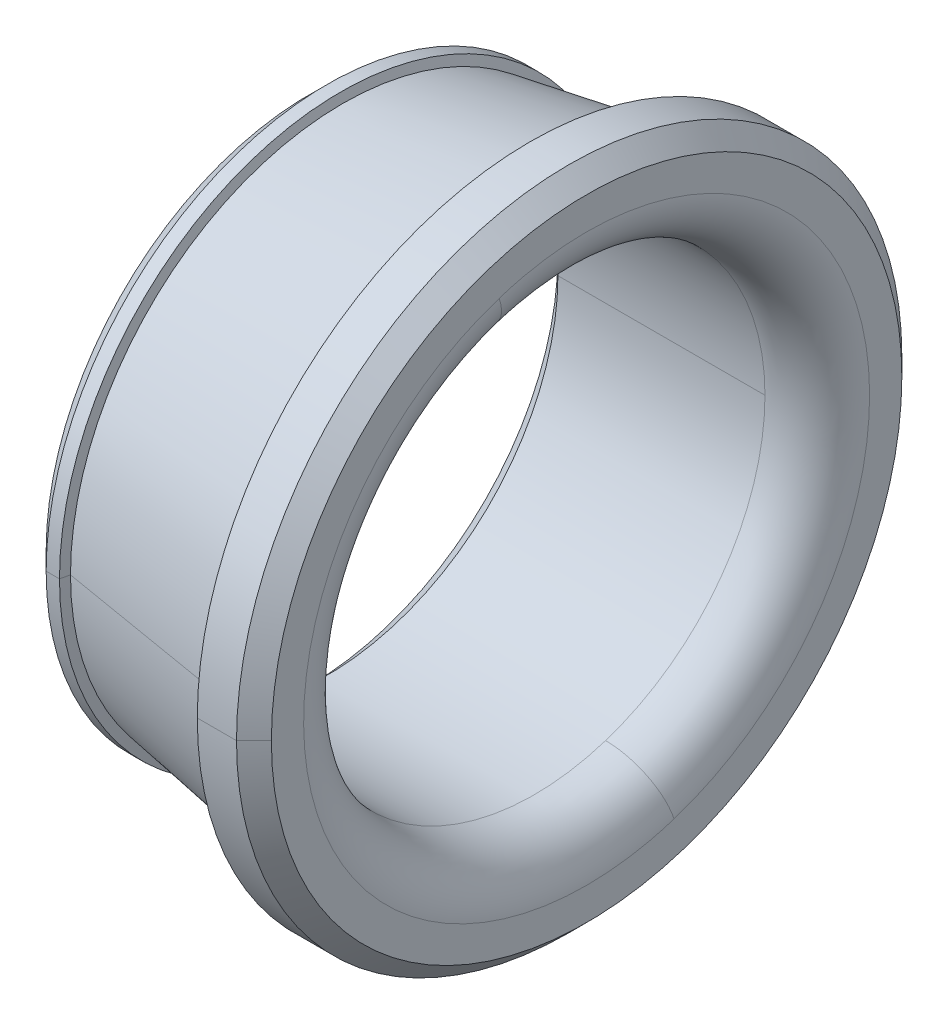
ISO-10303-21;
HEADER;
FILE_DESCRIPTION(('STEP AP214'),'2;1');
FILE_NAME('part.step','',(''),(''),'','','');
FILE_SCHEMA(('AUTOMOTIVE_DESIGN { 1 0 10303 214 1 1 1 1 }'));
ENDSEC;
DATA;
#1=APPLICATION_CONTEXT('core data for automotive mechanical design processes');
#2=APPLICATION_PROTOCOL_DEFINITION('international standard','automotive_design',2000,#1);
#3=PRODUCT_CONTEXT('',#1,'mechanical');
#4=PRODUCT('Part','Part','',(#3));
#5=PRODUCT_RELATED_PRODUCT_CATEGORY('part','',(#4));
#6=PRODUCT_DEFINITION_FORMATION('','',#4);
#7=PRODUCT_DEFINITION_CONTEXT('part definition',#1,'design');
#8=PRODUCT_DEFINITION('design','',#6,#7);
#9=PRODUCT_DEFINITION_SHAPE('','',#8);
#10=(LENGTH_UNIT() NAMED_UNIT(*) SI_UNIT(.MILLI.,.METRE.));
#11=(NAMED_UNIT(*) PLANE_ANGLE_UNIT() SI_UNIT($,.RADIAN.));
#12=(NAMED_UNIT(*) SI_UNIT($,.STERADIAN.) SOLID_ANGLE_UNIT());
#13=UNCERTAINTY_MEASURE_WITH_UNIT(LENGTH_MEASURE(1.E-05),#10,'distance_accuracy_value','');
#14=(GEOMETRIC_REPRESENTATION_CONTEXT(3) GLOBAL_UNCERTAINTY_ASSIGNED_CONTEXT((#13)) GLOBAL_UNIT_ASSIGNED_CONTEXT((#10,
#11,#12)) REPRESENTATION_CONTEXT('',''));
#15=CARTESIAN_POINT('',(0.,0.,0.));
#16=DIRECTION('',(0.,0.,1.));
#17=DIRECTION('',(1.,0.,0.));
#18=AXIS2_PLACEMENT_3D('',#15,#16,#17);
#19=CARTESIAN_POINT('',(-0.889,18.145,0.));
#20=DIRECTION('',(-1.,0.,0.));
#21=DIRECTION('',(0.,0.,1.));
#22=AXIS2_PLACEMENT_3D('',#19,#20,#21);
#23=PLANE('',#22);
#24=CARTESIAN_POINT('',(-0.889,0.,0.));
#25=DIRECTION('',(1.,0.,0.));
#26=DIRECTION('',(0.,0.,-1.));
#27=AXIS2_PLACEMENT_3D('',#24,#25,#26);
#28=CIRCLE('',#27,17.075);
#29=CARTESIAN_POINT('',(-0.889,0.,-17.075));
#30=VERTEX_POINT('',#29);
#31=CARTESIAN_POINT('',(-0.888999999999996,0.,17.075));
#32=VERTEX_POINT('',#31);
#33=EDGE_CURVE('E11',#30,#32,#28,.T.);
#34=ORIENTED_EDGE('',*,*,#33,.T.);
#35=CARTESIAN_POINT('',(-0.889,0.,0.));
#36=DIRECTION('',(1.,0.,0.));
#37=DIRECTION('',(0.,0.,-1.));
#38=AXIS2_PLACEMENT_3D('',#35,#36,#37);
#39=CIRCLE('',#38,17.075);
#40=EDGE_CURVE('E25',#32,#30,#39,.T.);
#41=ORIENTED_EDGE('',*,*,#40,.T.);
#42=EDGE_LOOP('',(#34,#41));
#43=FACE_BOUND('',#42,.T.);
#44=CARTESIAN_POINT('',(-0.889,0.,0.));
#45=DIRECTION('',(1.,0.,0.));
#46=DIRECTION('',(0.,0.,-1.));
#47=AXIS2_PLACEMENT_3D('',#44,#45,#46);
#48=CIRCLE('',#47,18.145);
#49=CARTESIAN_POINT('',(-0.889000000000003,0.,18.145));
#50=VERTEX_POINT('',#49);
#51=CARTESIAN_POINT('',(-0.889,0.,-18.145));
#52=VERTEX_POINT('',#51);
#53=EDGE_CURVE('E371',#50,#52,#48,.T.);
#54=ORIENTED_EDGE('',*,*,#53,.F.);
#55=CARTESIAN_POINT('',(-0.889,0.,0.));
#56=DIRECTION('',(1.,0.,0.));
#57=DIRECTION('',(0.,0.,-1.));
#58=AXIS2_PLACEMENT_3D('',#55,#56,#57);
#59=CIRCLE('',#58,18.145);
#60=EDGE_CURVE('E366',#52,#50,#59,.T.);
#61=ORIENTED_EDGE('',*,*,#60,.F.);
#62=EDGE_LOOP('',(#54,#61));
#63=FACE_BOUND('',#62,.T.);
#64=ADVANCED_FACE('F17',(#43,#63),#23,.T.);
#65=CARTESIAN_POINT('',(0.311,0.,0.));
#66=DIRECTION('',(1.,0.,0.));
#67=DIRECTION('',(0.,-1.,0.));
#68=AXIS2_PLACEMENT_3D('',#65,#66,#67);
#69=CONICAL_SURFACE('',#68,19.345,0.785398163397447);
#70=DIRECTION('',(0.707106781186549,0.,0.707106781186546));
#71=VECTOR('',#70,1.);
#72=CARTESIAN_POINT('',(-0.889000000000003,0.,18.145));
#73=LINE('',#72,#71);
#74=CARTESIAN_POINT('',(0.311,0.,19.345));
#75=VERTEX_POINT('',#74);
#76=EDGE_CURVE('E362',#50,#75,#73,.T.);
#77=ORIENTED_EDGE('',*,*,#76,.T.);
#78=CARTESIAN_POINT('',(0.311,0.,0.));
#79=DIRECTION('',(1.,0.,0.));
#80=DIRECTION('',(0.,0.,-1.));
#81=AXIS2_PLACEMENT_3D('',#78,#79,#80);
#82=CIRCLE('',#81,19.345);
#83=CARTESIAN_POINT('',(0.311,0.,-19.345));
#84=VERTEX_POINT('',#83);
#85=EDGE_CURVE('E357',#84,#75,#82,.T.);
#86=ORIENTED_EDGE('',*,*,#85,.F.);
#87=DIRECTION('',(0.707106781186549,0.,-0.707106781186546));
#88=VECTOR('',#87,1.);
#89=CARTESIAN_POINT('',(-0.889000000000003,0.,-18.145));
#90=LINE('',#89,#88);
#91=EDGE_CURVE('E352',#52,#84,#90,.T.);
#92=ORIENTED_EDGE('',*,*,#91,.F.);
#93=ORIENTED_EDGE('',*,*,#60,.T.);
#94=EDGE_LOOP('',(#77,#86,#92,#93));
#95=FACE_BOUND('',#94,.T.);
#96=ADVANCED_FACE('F387',(#95),#69,.T.);
#97=CARTESIAN_POINT('',(0.311,0.,0.));
#98=DIRECTION('',(1.,0.,0.));
#99=DIRECTION('',(0.,1.,0.));
#100=AXIS2_PLACEMENT_3D('',#97,#98,#99);
#101=CONICAL_SURFACE('',#100,19.345,0.785398163397447);
#102=ORIENTED_EDGE('',*,*,#76,.F.);
#103=ORIENTED_EDGE('',*,*,#53,.T.);
#104=ORIENTED_EDGE('',*,*,#91,.T.);
#105=CARTESIAN_POINT('',(0.311,0.,0.));
#106=DIRECTION('',(1.,0.,0.));
#107=DIRECTION('',(0.,0.,-1.));
#108=AXIS2_PLACEMENT_3D('',#105,#106,#107);
#109=CIRCLE('',#108,19.345);
#110=EDGE_CURVE('E347',#75,#84,#109,.T.);
#111=ORIENTED_EDGE('',*,*,#110,.F.);
#112=EDGE_LOOP('',(#102,#103,#104,#111));
#113=FACE_BOUND('',#112,.T.);
#114=ADVANCED_FACE('F382',(#113),#101,.T.);
#115=CARTESIAN_POINT('',(18.161,0.,0.));
#116=DIRECTION('',(1.,0.,0.));
#117=DIRECTION('',(0.,1.,-3.68433231910584E-13));
#118=AXIS2_PLACEMENT_3D('',#115,#116,#117);
#119=CYLINDRICAL_SURFACE('',#118,19.345);
#120=DIRECTION('',(1.,0.,0.));
#121=VECTOR('',#120,1.);
#122=CARTESIAN_POINT('',(0.311,0.,19.345));
#123=LINE('',#122,#121);
#124=CARTESIAN_POINT('',(1.2282218611991,0.,19.345));
#125=VERTEX_POINT('',#124);
#126=EDGE_CURVE('E342',#75,#125,#123,.T.);
#127=ORIENTED_EDGE('',*,*,#126,.F.);
#128=ORIENTED_EDGE('',*,*,#110,.T.);
#129=DIRECTION('',(1.,0.,0.));
#130=VECTOR('',#129,1.);
#131=CARTESIAN_POINT('',(0.311,0.,-19.345));
#132=LINE('',#131,#130);
#133=CARTESIAN_POINT('',(1.2282218611991,0.,-19.345));
#134=VERTEX_POINT('',#133);
#135=EDGE_CURVE('E338',#84,#134,#132,.T.);
#136=ORIENTED_EDGE('',*,*,#135,.T.);
#137=CARTESIAN_POINT('',(1.2282218611991,0.,0.));
#138=DIRECTION('',(1.,0.,0.));
#139=DIRECTION('',(0.,0.,-1.));
#140=AXIS2_PLACEMENT_3D('',#137,#138,#139);
#141=CIRCLE('',#140,19.345);
#142=EDGE_CURVE('E333',#125,#134,#141,.T.);
#143=ORIENTED_EDGE('',*,*,#142,.F.);
#144=EDGE_LOOP('',(#127,#128,#136,#143));
#145=FACE_BOUND('',#144,.T.);
#146=ADVANCED_FACE('F394',(#145),#119,.T.);
#147=CARTESIAN_POINT('',(1.3717754222754,0.,0.));
#148=DIRECTION('',(-1.,0.,0.));
#149=DIRECTION('',(0.,1.,0.));
#150=AXIS2_PLACEMENT_3D('',#147,#148,#149);
#151=CONICAL_SURFACE('',#150,18.73054483737,1.34128553015773);
#152=DIRECTION('',(-0.227501175399693,0.,-0.973777805863205));
#153=VECTOR('',#152,1.);
#154=CARTESIAN_POINT('',(1.37177542227541,0.,-18.73054483737));
#155=LINE('',#154,#153);
#156=CARTESIAN_POINT('',(1.3717754222754,0.,-18.73054483737));
#157=VERTEX_POINT('',#156);
#158=EDGE_CURVE('E328',#157,#134,#155,.T.);
#159=ORIENTED_EDGE('',*,*,#158,.F.);
#160=CARTESIAN_POINT('',(1.3717754222754,0.,0.));
#161=DIRECTION('',(1.,0.,0.));
#162=DIRECTION('',(0.,0.,-1.));
#163=AXIS2_PLACEMENT_3D('',#160,#161,#162);
#164=CIRCLE('',#163,18.73054483737);
#165=CARTESIAN_POINT('',(1.37177542227541,0.,18.73054483737));
#166=VERTEX_POINT('',#165);
#167=EDGE_CURVE('E323',#166,#157,#164,.T.);
#168=ORIENTED_EDGE('',*,*,#167,.F.);
#169=DIRECTION('',(-0.227501175399693,0.,0.973777805863205));
#170=VECTOR('',#169,1.);
#171=CARTESIAN_POINT('',(1.37177542227541,0.,18.73054483737));
#172=LINE('',#171,#170);
#173=EDGE_CURVE('E318',#166,#125,#172,.T.);
#174=ORIENTED_EDGE('',*,*,#173,.T.);
#175=ORIENTED_EDGE('',*,*,#142,.T.);
#176=EDGE_LOOP('',(#159,#168,#174,#175));
#177=FACE_BOUND('',#176,.T.);
#178=ADVANCED_FACE('F396',(#177),#151,.T.);
#179=CARTESIAN_POINT('',(1.3717754222754,0.,0.));
#180=DIRECTION('',(-1.,0.,0.));
#181=DIRECTION('',(0.,-1.,0.));
#182=AXIS2_PLACEMENT_3D('',#179,#180,#181);
#183=CONICAL_SURFACE('',#182,18.73054483737,1.34128553015773);
#184=ORIENTED_EDGE('',*,*,#158,.T.);
#185=CARTESIAN_POINT('',(1.2282218611991,0.,0.));
#186=DIRECTION('',(1.,0.,0.));
#187=DIRECTION('',(0.,0.,-1.));
#188=AXIS2_PLACEMENT_3D('',#185,#186,#187);
#189=CIRCLE('',#188,19.345);
#190=EDGE_CURVE('E313',#134,#125,#189,.T.);
#191=ORIENTED_EDGE('',*,*,#190,.T.);
#192=ORIENTED_EDGE('',*,*,#173,.F.);
#193=CARTESIAN_POINT('',(1.3717754222754,0.,0.));
#194=DIRECTION('',(1.,0.,0.));
#195=DIRECTION('',(0.,0.,-1.));
#196=AXIS2_PLACEMENT_3D('',#193,#194,#195);
#197=CIRCLE('',#196,18.73054483737);
#198=EDGE_CURVE('E308',#157,#166,#197,.T.);
#199=ORIENTED_EDGE('',*,*,#198,.F.);
#200=EDGE_LOOP('',(#184,#191,#192,#199));
#201=FACE_BOUND('',#200,.T.);
#202=ADVANCED_FACE('F401',(#201),#183,.T.);
#203=CARTESIAN_POINT('',(14.70922761171,0.,0.));
#204=DIRECTION('',(1.,0.,0.));
#205=DIRECTION('',(0.,-1.,0.));
#206=AXIS2_PLACEMENT_3D('',#203,#204,#205);
#207=CONICAL_SURFACE('',#206,20.982335713908,0.167254902218641);
#208=DIRECTION('',(0.986045474952207,0.,0.166476188466329));
#209=VECTOR('',#208,1.);
#210=CARTESIAN_POINT('',(1.3717754222754,0.,18.73054483737));
#211=LINE('',#210,#209);
#212=CARTESIAN_POINT('',(14.70922761171,0.,20.982335713908));
#213=VERTEX_POINT('',#212);
#214=EDGE_CURVE('E304',#166,#213,#211,.T.);
#215=ORIENTED_EDGE('',*,*,#214,.T.);
#216=CARTESIAN_POINT('',(14.70922761171,0.,0.));
#217=DIRECTION('',(1.,0.,0.));
#218=DIRECTION('',(0.,0.,-1.));
#219=AXIS2_PLACEMENT_3D('',#216,#217,#218);
#220=CIRCLE('',#219,20.982335713908);
#221=CARTESIAN_POINT('',(14.70922761171,0.,-20.982335713908));
#222=VERTEX_POINT('',#221);
#223=EDGE_CURVE('E299',#222,#213,#220,.T.);
#224=ORIENTED_EDGE('',*,*,#223,.F.);
#225=DIRECTION('',(0.986045474952207,0.,-0.166476188466329));
#226=VECTOR('',#225,1.);
#227=CARTESIAN_POINT('',(1.3717754222754,0.,-18.73054483737));
#228=LINE('',#227,#226);
#229=EDGE_CURVE('E294',#157,#222,#228,.T.);
#230=ORIENTED_EDGE('',*,*,#229,.F.);
#231=ORIENTED_EDGE('',*,*,#198,.T.);
#232=EDGE_LOOP('',(#215,#224,#230,#231));
#233=FACE_BOUND('',#232,.T.);
#234=ADVANCED_FACE('F408',(#233),#207,.T.);
#235=CARTESIAN_POINT('',(14.70922761171,0.,0.));
#236=DIRECTION('',(1.,0.,0.));
#237=DIRECTION('',(0.,1.,0.));
#238=AXIS2_PLACEMENT_3D('',#235,#236,#237);
#239=CONICAL_SURFACE('',#238,20.982335713908,0.167254902218641);
#240=ORIENTED_EDGE('',*,*,#214,.F.);
#241=ORIENTED_EDGE('',*,*,#167,.T.);
#242=ORIENTED_EDGE('',*,*,#229,.T.);
#243=CARTESIAN_POINT('',(14.70922761171,0.,0.));
#244=DIRECTION('',(1.,0.,0.));
#245=DIRECTION('',(0.,0.,-1.));
#246=AXIS2_PLACEMENT_3D('',#243,#244,#245);
#247=CIRCLE('',#246,20.982335713908);
#248=EDGE_CURVE('E289',#213,#222,#247,.T.);
#249=ORIENTED_EDGE('',*,*,#248,.F.);
#250=EDGE_LOOP('',(#240,#241,#242,#249));
#251=FACE_BOUND('',#250,.T.);
#252=ADVANCED_FACE('F405',(#251),#239,.T.);
#253=CARTESIAN_POINT('',(14.262376830545,0.,0.));
#254=DIRECTION('',(-1.,0.,0.));
#255=DIRECTION('',(0.,1.,0.));
#256=AXIS2_PLACEMENT_3D('',#253,#254,#255);
#257=CONICAL_SURFACE('',#256,22.895,1.34128553015764);
#258=DIRECTION('',(-0.227501175399776,0.,-0.973777805863186));
#259=VECTOR('',#258,1.);
#260=CARTESIAN_POINT('',(14.70922761171,0.,-20.982335713908));
#261=LINE('',#260,#259);
#262=CARTESIAN_POINT('',(14.262376830545,0.,-22.895));
#263=VERTEX_POINT('',#262);
#264=EDGE_CURVE('E285',#222,#263,#261,.T.);
#265=ORIENTED_EDGE('',*,*,#264,.T.);
#266=CARTESIAN_POINT('',(14.262376830545,0.,0.));
#267=DIRECTION('',(1.,0.,0.));
#268=DIRECTION('',(0.,0.,-1.));
#269=AXIS2_PLACEMENT_3D('',#266,#267,#268);
#270=CIRCLE('',#269,22.895);
#271=CARTESIAN_POINT('',(14.262376830545,0.,22.895));
#272=VERTEX_POINT('',#271);
#273=EDGE_CURVE('E280',#272,#263,#270,.T.);
#274=ORIENTED_EDGE('',*,*,#273,.F.);
#275=DIRECTION('',(-0.227501175399777,0.,0.973777805863186));
#276=VECTOR('',#275,1.);
#277=CARTESIAN_POINT('',(14.70922761171,0.,20.982335713908));
#278=LINE('',#277,#276);
#279=EDGE_CURVE('E275',#213,#272,#278,.T.);
#280=ORIENTED_EDGE('',*,*,#279,.F.);
#281=ORIENTED_EDGE('',*,*,#248,.T.);
#282=EDGE_LOOP('',(#265,#274,#280,#281));
#283=FACE_BOUND('',#282,.T.);
#284=ADVANCED_FACE('F410',(#283),#257,.F.);
#285=CARTESIAN_POINT('',(14.262376830545,0.,0.));
#286=DIRECTION('',(-1.,0.,0.));
#287=DIRECTION('',(0.,-1.,0.));
#288=AXIS2_PLACEMENT_3D('',#285,#286,#287);
#289=CONICAL_SURFACE('',#288,22.895,1.34128553015764);
#290=ORIENTED_EDGE('',*,*,#264,.F.);
#291=ORIENTED_EDGE('',*,*,#223,.T.);
#292=ORIENTED_EDGE('',*,*,#279,.T.);
#293=CARTESIAN_POINT('',(14.262376830545,0.,0.));
#294=DIRECTION('',(1.,0.,0.));
#295=DIRECTION('',(0.,0.,-1.));
#296=AXIS2_PLACEMENT_3D('',#293,#294,#295);
#297=CIRCLE('',#296,22.895);
#298=EDGE_CURVE('E270',#263,#272,#297,.T.);
#299=ORIENTED_EDGE('',*,*,#298,.F.);
#300=EDGE_LOOP('',(#290,#291,#292,#299));
#301=FACE_BOUND('',#300,.T.);
#302=ADVANCED_FACE('F415',(#301),#289,.F.);
#303=CARTESIAN_POINT('',(18.161,0.,0.));
#304=DIRECTION('',(1.,0.,0.));
#305=DIRECTION('',(0.,-1.,0.));
#306=AXIS2_PLACEMENT_3D('',#303,#304,#305);
#307=CYLINDRICAL_SURFACE('',#306,22.895);
#308=DIRECTION('',(1.,0.,0.));
#309=VECTOR('',#308,1.);
#310=CARTESIAN_POINT('',(14.262376830545,0.,22.895));
#311=LINE('',#310,#309);
#312=CARTESIAN_POINT('',(16.961,0.,22.895));
#313=VERTEX_POINT('',#312);
#314=EDGE_CURVE('E266',#272,#313,#311,.T.);
#315=ORIENTED_EDGE('',*,*,#314,.T.);
#316=CARTESIAN_POINT('',(16.961,0.,0.));
#317=DIRECTION('',(1.,0.,0.));
#318=DIRECTION('',(0.,0.,-1.));
#319=AXIS2_PLACEMENT_3D('',#316,#317,#318);
#320=CIRCLE('',#319,22.895);
#321=CARTESIAN_POINT('',(16.961,0.,-22.895));
#322=VERTEX_POINT('',#321);
#323=EDGE_CURVE('E261',#322,#313,#320,.T.);
#324=ORIENTED_EDGE('',*,*,#323,.F.);
#325=DIRECTION('',(1.,0.,0.));
#326=VECTOR('',#325,1.);
#327=CARTESIAN_POINT('',(14.262376830545,0.,-22.895));
#328=LINE('',#327,#326);
#329=EDGE_CURVE('E256',#263,#322,#328,.T.);
#330=ORIENTED_EDGE('',*,*,#329,.F.);
#331=ORIENTED_EDGE('',*,*,#298,.T.);
#332=EDGE_LOOP('',(#315,#324,#330,#331));
#333=FACE_BOUND('',#332,.T.);
#334=ADVANCED_FACE('F418',(#333),#307,.T.);
#335=CARTESIAN_POINT('',(18.161,0.,0.));
#336=DIRECTION('',(1.,0.,0.));
#337=DIRECTION('',(0.,1.,-1.65040373799256E-13));
#338=AXIS2_PLACEMENT_3D('',#335,#336,#337);
#339=CYLINDRICAL_SURFACE('',#338,22.895);
#340=ORIENTED_EDGE('',*,*,#314,.F.);
#341=ORIENTED_EDGE('',*,*,#273,.T.);
#342=ORIENTED_EDGE('',*,*,#329,.T.);
#343=CARTESIAN_POINT('',(16.961,0.,0.));
#344=DIRECTION('',(1.,0.,0.));
#345=DIRECTION('',(0.,0.,-1.));
#346=AXIS2_PLACEMENT_3D('',#343,#344,#345);
#347=CIRCLE('',#346,22.895);
#348=EDGE_CURVE('E251',#313,#322,#347,.T.);
#349=ORIENTED_EDGE('',*,*,#348,.F.);
#350=EDGE_LOOP('',(#340,#341,#342,#349));
#351=FACE_BOUND('',#350,.T.);
#352=ADVANCED_FACE('F421',(#351),#339,.T.);
#353=CARTESIAN_POINT('',(18.161,0.,0.));
#354=DIRECTION('',(-1.,0.,0.));
#355=DIRECTION('',(0.,1.,0.));
#356=AXIS2_PLACEMENT_3D('',#353,#354,#355);
#357=CONICAL_SURFACE('',#356,21.695,0.785398163397448);
#358=DIRECTION('',(-0.707106781186548,0.,-0.707106781186548));
#359=VECTOR('',#358,1.);
#360=CARTESIAN_POINT('',(18.161,0.,-21.695));
#361=LINE('',#360,#359);
#362=CARTESIAN_POINT('',(18.161,0.,-21.695));
#363=VERTEX_POINT('',#362);
#364=EDGE_CURVE('E246',#363,#322,#361,.T.);
#365=ORIENTED_EDGE('',*,*,#364,.F.);
#366=CARTESIAN_POINT('',(18.161,0.,0.));
#367=DIRECTION('',(1.,0.,0.));
#368=DIRECTION('',(0.,0.,-1.));
#369=AXIS2_PLACEMENT_3D('',#366,#367,#368);
#370=CIRCLE('',#369,21.695);
#371=CARTESIAN_POINT('',(18.161,0.,21.695));
#372=VERTEX_POINT('',#371);
#373=EDGE_CURVE('E241',#372,#363,#370,.T.);
#374=ORIENTED_EDGE('',*,*,#373,.F.);
#375=DIRECTION('',(-0.707106781186548,0.,0.707106781186548));
#376=VECTOR('',#375,1.);
#377=CARTESIAN_POINT('',(18.161,0.,21.695));
#378=LINE('',#377,#376);
#379=EDGE_CURVE('E236',#372,#313,#378,.T.);
#380=ORIENTED_EDGE('',*,*,#379,.T.);
#381=ORIENTED_EDGE('',*,*,#348,.T.);
#382=EDGE_LOOP('',(#365,#374,#380,#381));
#383=FACE_BOUND('',#382,.T.);
#384=ADVANCED_FACE('F423',(#383),#357,.T.);
#385=CARTESIAN_POINT('',(18.161,0.,0.));
#386=DIRECTION('',(-1.,0.,0.));
#387=DIRECTION('',(0.,-1.,0.));
#388=AXIS2_PLACEMENT_3D('',#385,#386,#387);
#389=CONICAL_SURFACE('',#388,21.695,0.785398163397448);
#390=ORIENTED_EDGE('',*,*,#364,.T.);
#391=ORIENTED_EDGE('',*,*,#323,.T.);
#392=ORIENTED_EDGE('',*,*,#379,.F.);
#393=CARTESIAN_POINT('',(18.161,0.,0.));
#394=DIRECTION('',(1.,0.,0.));
#395=DIRECTION('',(0.,0.,-1.));
#396=AXIS2_PLACEMENT_3D('',#393,#394,#395);
#397=CIRCLE('',#396,21.695);
#398=EDGE_CURVE('E233',#363,#372,#397,.T.);
#399=ORIENTED_EDGE('',*,*,#398,.F.);
#400=EDGE_LOOP('',(#390,#391,#392,#399));
#401=FACE_BOUND('',#400,.T.);
#402=ADVANCED_FACE('F427',(#401),#389,.T.);
#403=CARTESIAN_POINT('',(18.161,19.475,0.));
#404=DIRECTION('',(1.,0.,0.));
#405=DIRECTION('',(0.,0.,-1.));
#406=AXIS2_PLACEMENT_3D('',#403,#404,#405);
#407=PLANE('',#406);
#408=ORIENTED_EDGE('',*,*,#398,.T.);
#409=ORIENTED_EDGE('',*,*,#373,.T.);
#410=EDGE_LOOP('',(#408,#409));
#411=FACE_BOUND('',#410,.T.);
#412=CARTESIAN_POINT('',(18.161,-18.5218256548467,-6.01810596545168));
#413=CARTESIAN_POINT('',(18.161,-18.4233609555331,-6.32117102389814));
#414=CARTESIAN_POINT('',(18.161,-18.3174455285278,-6.62181458939491));
#415=CARTESIAN_POINT('',(18.161,-18.0909961536814,-7.21754501547632));
#416=CARTESIAN_POINT('',(18.161,-17.9704622058403,-7.51263187606095));
#417=CARTESIAN_POINT('',(18.161,-17.7150587238695,-8.09653517330528));
#418=CARTESIAN_POINT('',(18.161,-17.5801891897397,-8.38535160996497));
#419=CARTESIAN_POINT('',(18.161,-17.2964414418684,-8.95601903327277));
#420=CARTESIAN_POINT('',(18.161,-17.1475632281267,-9.23787001992086));
#421=CARTESIAN_POINT('',(18.161,-16.8361562473562,-9.79392733638415));
#422=CARTESIAN_POINT('',(18.161,-16.6736274803272,-10.0681336661993));
#423=CARTESIAN_POINT('',(18.161,-16.3353110821917,-10.6082411363531));
#424=CARTESIAN_POINT('',(18.161,-16.1595234510851,-10.8741422766916));
#425=CARTESIAN_POINT('',(18.161,-15.7951127742313,-11.3969987741723));
#426=CARTESIAN_POINT('',(18.161,-15.6064897284841,-11.6539541313145));
#427=CARTESIAN_POINT('',(18.161,-15.2168626420673,-12.1583000383478));
#428=CARTESIAN_POINT('',(18.161,-15.0158586013976,-12.405690588239));
#429=CARTESIAN_POINT('',(18.161,-14.6019537587213,-12.8903108942198));
#430=CARTESIAN_POINT('',(18.161,-14.3890529567147,-13.1275406503095));
#431=CARTESIAN_POINT('',(18.161,-13.9518674887824,-13.5912678617066));
#432=CARTESIAN_POINT('',(18.161,-13.7275828228567,-13.817765317014));
#433=CARTESIAN_POINT('',(18.161,-13.2681699482938,-14.2594822745627));
#434=CARTESIAN_POINT('',(18.161,-13.0330417396566,-14.474701776804));
#435=CARTESIAN_POINT('',(18.161,-12.552508224173,-14.8933443456087));
#436=CARTESIAN_POINT('',(18.161,-12.3071029173266,-15.0967674121721));
#437=CARTESIAN_POINT('',(18.161,-11.8066064082896,-15.4913270456306));
#438=CARTESIAN_POINT('',(18.161,-11.5515152060991,-15.6824636125257));
#439=CARTESIAN_POINT('',(18.161,-11.0322614434269,-16.0519897819177));
#440=CARTESIAN_POINT('',(18.161,-10.7680988829454,-16.2303793844146));
#441=CARTESIAN_POINT('',(18.161,-10.2313387944365,-16.5739818688323));
#442=CARTESIAN_POINT('',(18.161,-9.95874126640905,-16.7391947507532));
#443=CARTESIAN_POINT('',(18.161,-9.40576795413037,-17.0560457817155));
#444=CARTESIAN_POINT('',(18.161,-9.1253921698791,-17.207683930757));
#445=CARTESIAN_POINT('',(18.161,-8.5575377949749,-17.4970201863774));
#446=CARTESIAN_POINT('',(18.161,-8.27005920432198,-17.6347182929564));
#447=CARTESIAN_POINT('',(18.161,-7.68869177771954,-17.8958427368523));
#448=CARTESIAN_POINT('',(18.161,-7.39480294177002,-18.0192690741692));
#449=CARTESIAN_POINT('',(18.161,-6.80132302852179,-18.2515526346835));
#450=CARTESIAN_POINT('',(18.161,-6.50173195122309,-18.3604098578808));
#451=CARTESIAN_POINT('',(18.161,-5.89756929642279,-18.5632929435705));
#452=CARTESIAN_POINT('',(18.161,-5.5929977189212,-18.6573188060628));
#453=CARTESIAN_POINT('',(18.161,-4.97960780332265,-18.830312653804));
#454=CARTESIAN_POINT('',(18.161,-4.67078946522569,-18.9092806390528));
#455=CARTESIAN_POINT('',(18.161,-4.04964999886217,-19.0519684915139));
#456=CARTESIAN_POINT('',(18.161,-3.73732887059562,-19.115688358726));
#457=CARTESIAN_POINT('',(18.161,-3.10993623284699,-19.2277264683724));
#458=CARTESIAN_POINT('',(18.161,-2.79486472336493,-19.2760447108065));
#459=CARTESIAN_POINT('',(18.161,-2.16273035804864,-19.3571631680186));
#460=CARTESIAN_POINT('',(18.161,-1.84566750221441,-19.3899633827966));
#461=CARTESIAN_POINT('',(18.161,-1.21031427638493,-19.4399667661059));
#462=CARTESIAN_POINT('',(18.161,-0.892023906389676,-19.4571699346372));
#463=CARTESIAN_POINT('',(18.161,-0.254982441618408,-19.4759377815136));
#464=CARTESIAN_POINT('',(18.161,0.0637686531576066,-19.4775024598586));
#465=CARTESIAN_POINT('',(18.161,0.700963668183792,-19.464989556915));
#466=CARTESIAN_POINT('',(18.161,1.01940758843396,-19.4509119756264));
#467=CARTESIAN_POINT('',(18.161,1.65522109511218,-19.407148467542));
#468=CARTESIAN_POINT('',(18.161,1.97259068154022,-19.3774625407462));
#469=CARTESIAN_POINT('',(18.161,2.60549094944218,-19.3025538576453));
#470=CARTESIAN_POINT('',(18.161,2.92102163091611,-19.2573311013401));
#471=CARTESIAN_POINT('',(18.161,3.54948394786094,-19.1514577048015));
#472=CARTESIAN_POINT('',(18.161,3.86241558333185,-19.0908070645679));
#473=CARTESIAN_POINT('',(18.161,4.48492592855122,-18.9542240128772));
#474=CARTESIAN_POINT('',(18.161,4.79450463829969,-18.87829160142));
#475=CARTESIAN_POINT('',(18.161,5.40956332984651,-18.711327935112));
#476=CARTESIAN_POINT('',(18.161,5.71504331164486,-18.6202966802612));
#477=CARTESIAN_POINT('',(18.161,6.3211686192584,-18.4233546294323));
#478=CARTESIAN_POINT('',(18.161,6.6218139450736,-18.3174438334542));
#479=CARTESIAN_POINT('',(18.161,7.21754565979753,-18.090997848755));
#480=CARTESIAN_POINT('',(18.161,7.51263204870626,-17.9704626600339));
#481=CARTESIAN_POINT('',(18.161,8.09653500065987,-17.7150582696759));
#482=CARTESIAN_POINT('',(18.161,8.38535156370474,-17.580189068039));
#483=CARTESIAN_POINT('',(18.161,8.95601907953291,-17.2964415635692));
#484=CARTESIAN_POINT('',(18.161,9.2378700323162,-17.1475632607364));
#485=CARTESIAN_POINT('',(18.161,9.79392732398873,-16.8361562147466));
#486=CARTESIAN_POINT('',(18.161,10.068133662878,-16.6736274715895));
#487=CARTESIAN_POINT('',(18.161,10.6082411396743,-16.3353110909295));
#488=CARTESIAN_POINT('',(18.161,10.8741422775815,-16.1595234534264));
#489=CARTESIAN_POINT('',(18.161,11.3969987732823,-15.79511277189));
#490=CARTESIAN_POINT('',(18.161,11.653954131076,-15.6064897278568));
#491=CARTESIAN_POINT('',(18.161,12.1583000385862,-15.2168626426947));
#492=CARTESIAN_POINT('',(18.161,12.4056905883028,-15.0158586015658));
#493=CARTESIAN_POINT('',(18.161,12.8903108941559,-14.6019537585533));
#494=CARTESIAN_POINT('',(18.161,13.1275406502923,-14.3890529566697));
#495=CARTESIAN_POINT('',(18.161,13.5912678617236,-13.9518674888274));
#496=CARTESIAN_POINT('',(18.161,13.8177653170185,-13.7275828228688));
#497=CARTESIAN_POINT('',(18.161,14.259482274558,-13.2681699482818));
#498=CARTESIAN_POINT('',(18.161,14.4747017768027,-13.0330417396534));
#499=CARTESIAN_POINT('',(18.161,14.8933443456099,-12.5525082241762));
#500=CARTESIAN_POINT('',(18.161,15.0967674121724,-12.3071029173275));
#501=CARTESIAN_POINT('',(18.161,15.4913270456303,-11.8066064082888));
#502=CARTESIAN_POINT('',(18.161,15.6824636125256,-11.5515152060989));
#503=CARTESIAN_POINT('',(18.161,16.0519897819177,-11.0322614434272));
#504=CARTESIAN_POINT('',(18.161,16.2303793844146,-10.7680988829455));
#505=CARTESIAN_POINT('',(18.161,16.5739818688323,-10.2313387944365));
#506=CARTESIAN_POINT('',(18.161,16.7391947507532,-9.95874126640909));
#507=CARTESIAN_POINT('',(18.161,17.0560457817155,-9.40576795413044));
#508=CARTESIAN_POINT('',(18.161,17.2076839307569,-9.12539216987916));
#509=CARTESIAN_POINT('',(18.161,17.4970201863774,-8.55753779497496));
#510=CARTESIAN_POINT('',(18.161,17.6347182929564,-8.27005920432204));
#511=CARTESIAN_POINT('',(18.161,17.8958427368523,-7.68869177771959));
#512=CARTESIAN_POINT('',(18.161,18.0192690741693,-7.39480294177005));
#513=CARTESIAN_POINT('',(18.161,18.2515526346834,-6.80132302852186));
#514=CARTESIAN_POINT('',(18.161,18.3604098578806,-6.5017319512232));
#515=CARTESIAN_POINT('',(18.161,18.5632929435707,-5.89756929642278));
#516=CARTESIAN_POINT('',(18.161,18.6573188060637,-5.59299771892101));
#517=CARTESIAN_POINT('',(18.161,18.8303126538031,-4.97960780332295));
#518=CARTESIAN_POINT('',(18.161,18.9092806390495,-4.67078946522665));
#519=CARTESIAN_POINT('',(18.161,19.0519684915172,-4.04964999886132));
#520=CARTESIAN_POINT('',(18.161,19.1156883587385,-3.73732887059229));
#521=CARTESIAN_POINT('',(18.161,19.2277264683599,-3.10993623285043));
#522=CARTESIAN_POINT('',(18.161,19.27604471076,-2.79486472337761));
#523=CARTESIAN_POINT('',(18.161,19.3571631680651,-2.16273035803607));
#524=CARTESIAN_POINT('',(18.161,19.3899633829701,-1.84566750216736));
#525=CARTESIAN_POINT('',(18.161,19.4399667659323,-1.21031427643211));
#526=CARTESIAN_POINT('',(18.161,19.4571699339895,-0.892023906565566));
#527=CARTESIAN_POINT('',(18.161,19.4759377821613,-0.254982441442653));
#528=CARTESIAN_POINT('',(18.161,19.4775024622758,0.0637686538137201));
#529=CARTESIAN_POINT('',(18.161,19.4649895544977,0.700963667527548));
#530=CARTESIAN_POINT('',(18.161,19.4509119666052,1.019407585985));
#531=CARTESIAN_POINT('',(18.161,19.4071484765632,1.65522109756101));
#532=CARTESIAN_POINT('',(18.161,19.3774625744138,1.97259069067956));
#533=CARTESIAN_POINT('',(18.161,19.3025538239777,2.60549094030275));
#534=CARTESIAN_POINT('',(18.161,19.2573309756911,2.9210215968074));
#535=CARTESIAN_POINT('',(18.161,19.1514578304506,3.54948398196956));
#536=CARTESIAN_POINT('',(18.161,19.0908075334967,3.86241571062707));
#537=CARTESIAN_POINT('',(18.161,18.9542235439485,4.4849258012559));
#538=CARTESIAN_POINT('',(18.161,18.8782898513541,4.79450416322723));
#539=CARTESIAN_POINT('',(18.161,18.7113296851779,5.40956380491887));
#540=CARTESIAN_POINT('',(18.161,18.620303211596,5.71504508463918));
#541=CARTESIAN_POINT('',(18.161,18.5218256548468,6.01810596545158));
#542=B_SPLINE_CURVE_WITH_KNOTS('',3,(#412,#413,#414,#415,#416,#417,#418,#419,#420,#421,#422,
#423,#424,#425,#426,#427,#428,#429,#430,#431,#432,#433,#434,#435,#436,#437,#438,#439,#440,#441,
#442,#443,#444,#445,#446,#447,#448,#449,#450,#451,#452,#453,#454,#455,#456,#457,#458,#459,#460,
#461,#462,#463,#464,#465,#466,#467,#468,#469,#470,#471,#472,#473,#474,#475,#476,#477,#478,#479,
#480,#481,#482,#483,#484,#485,#486,#487,#488,#489,#490,#491,#492,#493,#494,#495,#496,#497,#498,
#499,#500,#501,#502,#503,#504,#505,#506,#507,#508,#509,#510,#511,#512,#513,#514,#515,#516,#517,
#518,#519,#520,#521,#522,#523,#524,#525,#526,#527,#528,#529,#530,#531,#532,#533,#534,#535,#536,
#537,#538,#539,#540,#541),.UNSPECIFIED.,.F.,.F.,(4,2,2,2,2,2,2,2,2,2,2,2,2,2,2,2,2,2,2,2,2,2,2,
2,2,2,2,2,2,2,2,2,2,2,2,2,2,2,2,2,2,2,2,2,2,2,2,2,2,2,2,2,2,2,2,2,2,2,2,2,2,2,2,2,4),(0.,
0.955880850967359,1.91176170193472,2.86764255290208,3.82352340386944,4.7794042548368,
5.73528510580416,6.69116595677152,7.64704680773888,8.60292765870624,9.5588085096736,
10.514689360641,11.4705702116083,12.4264510625757,13.382331913543,14.3382127645104,
15.2940936154778,16.2499744664451,17.2058553174125,18.1617361683798,19.1176170193472,
20.0734978703146,21.0293787212819,21.9852595722493,22.9411404232166,23.897021274184,
24.8529021251514,25.8087829761187,26.7646638270861,27.7205446780534,28.6764255290208,
29.6323063799882,30.5881872309555,31.5440680819229,32.4999489328902,33.4558297838576,
34.411710634825,35.3675914857923,36.3234723367597,37.2793531877271,38.2352340386944,
39.1911148896618,40.1469957406291,41.1028765915965,42.0587574425638,43.0146382935312,
43.9705191444986,44.9263999954659,45.8822808464333,46.8381616974007,47.794042548368,
48.7499233993354,49.7058042503027,50.6616851012701,51.6175659522374,52.5734468032048,
53.5293276541722,54.4852085051395,55.4410893561069,56.3969702070742,57.3528510580416,
58.308731909009,59.2646127599763,60.2204936109437,61.176374461911),.UNSPECIFIED.);
#543=CARTESIAN_POINT('',(18.161,-18.5218256548467,-6.01810596545165));
#544=VERTEX_POINT('',#543);
#545=CARTESIAN_POINT('',(18.161,18.5218256548467,6.01810596545165));
#546=VERTEX_POINT('',#545);
#547=EDGE_CURVE('E232',#544,#546,#542,.T.);
#548=ORIENTED_EDGE('',*,*,#547,.F.);
#549=CARTESIAN_POINT('',(18.161,18.5218256548467,6.01810596545169));
#550=CARTESIAN_POINT('',(18.161,18.4233609555331,6.32117102389814));
#551=CARTESIAN_POINT('',(18.161,18.3174455285278,6.62181458939491));
#552=CARTESIAN_POINT('',(18.161,18.0909961536814,7.21754501547632));
#553=CARTESIAN_POINT('',(18.161,17.9704622058403,7.51263187606095));
#554=CARTESIAN_POINT('',(18.161,17.7150587238695,8.09653517330528));
#555=CARTESIAN_POINT('',(18.161,17.5801891897397,8.38535160996497));
#556=CARTESIAN_POINT('',(18.161,17.2964414418684,8.95601903327277));
#557=CARTESIAN_POINT('',(18.161,17.1475632281267,9.23787001992087));
#558=CARTESIAN_POINT('',(18.161,16.8361562473562,9.79392733638415));
#559=CARTESIAN_POINT('',(18.161,16.6736274803272,10.0681336661993));
#560=CARTESIAN_POINT('',(18.161,16.3353110821917,10.6082411363531));
#561=CARTESIAN_POINT('',(18.161,16.1595234510851,10.8741422766916));
#562=CARTESIAN_POINT('',(18.161,15.7951127742313,11.3969987741723));
#563=CARTESIAN_POINT('',(18.161,15.6064897284841,11.6539541313145));
#564=CARTESIAN_POINT('',(18.161,15.2168626420673,12.1583000383478));
#565=CARTESIAN_POINT('',(18.161,15.0158586013976,12.405690588239));
#566=CARTESIAN_POINT('',(18.161,14.6019537587213,12.8903108942198));
#567=CARTESIAN_POINT('',(18.161,14.3890529567147,13.1275406503095));
#568=CARTESIAN_POINT('',(18.161,13.9518674887824,13.5912678617066));
#569=CARTESIAN_POINT('',(18.161,13.7275828228567,13.817765317014));
#570=CARTESIAN_POINT('',(18.161,13.2681699482938,14.2594822745627));
#571=CARTESIAN_POINT('',(18.161,13.0330417396566,14.474701776804));
#572=CARTESIAN_POINT('',(18.161,12.5525082241729,14.8933443456087));
#573=CARTESIAN_POINT('',(18.161,12.3071029173266,15.0967674121721));
#574=CARTESIAN_POINT('',(18.161,11.8066064082896,15.4913270456306));
#575=CARTESIAN_POINT('',(18.161,11.551515206099,15.6824636125257));
#576=CARTESIAN_POINT('',(18.161,11.0322614434269,16.0519897819177));
#577=CARTESIAN_POINT('',(18.161,10.7680988829454,16.2303793844146));
#578=CARTESIAN_POINT('',(18.161,10.2313387944365,16.5739818688323));
#579=CARTESIAN_POINT('',(18.161,9.95874126640904,16.7391947507532));
#580=CARTESIAN_POINT('',(18.161,9.40576795413036,17.0560457817155));
#581=CARTESIAN_POINT('',(18.161,9.12539216987909,17.207683930757));
#582=CARTESIAN_POINT('',(18.161,8.5575377949749,17.4970201863774));
#583=CARTESIAN_POINT('',(18.161,8.27005920432197,17.6347182929564));
#584=CARTESIAN_POINT('',(18.161,7.68869177771953,17.8958427368523));
#585=CARTESIAN_POINT('',(18.161,7.39480294177,18.0192690741692));
#586=CARTESIAN_POINT('',(18.161,6.80132302852177,18.2515526346835));
#587=CARTESIAN_POINT('',(18.161,6.50173195122307,18.3604098578808));
#588=CARTESIAN_POINT('',(18.161,5.89756929642277,18.5632929435705));
#589=CARTESIAN_POINT('',(18.161,5.59299771892118,18.6573188060628));
#590=CARTESIAN_POINT('',(18.161,4.97960780332263,18.830312653804));
#591=CARTESIAN_POINT('',(18.161,4.67078946522567,18.9092806390528));
#592=CARTESIAN_POINT('',(18.161,4.04964999886215,19.0519684915139));
#593=CARTESIAN_POINT('',(18.161,3.73732887059559,19.115688358726));
#594=CARTESIAN_POINT('',(18.161,3.10993623284696,19.2277264683724));
#595=CARTESIAN_POINT('',(18.161,2.79486472336489,19.2760447108065));
#596=CARTESIAN_POINT('',(18.161,2.1627303580486,19.3571631680186));
#597=CARTESIAN_POINT('',(18.161,1.84566750221438,19.3899633827966));
#598=CARTESIAN_POINT('',(18.161,1.21031427638491,19.4399667661059));
#599=CARTESIAN_POINT('',(18.161,0.892023906389654,19.4571699346372));
#600=CARTESIAN_POINT('',(18.161,0.254982441618386,19.4759377815136));
#601=CARTESIAN_POINT('',(18.161,-0.0637686531576309,19.4775024598586));
#602=CARTESIAN_POINT('',(18.161,-0.700963668183817,19.464989556915));
#603=CARTESIAN_POINT('',(18.161,-1.01940758843399,19.4509119756264));
#604=CARTESIAN_POINT('',(18.161,-1.6552210951122,19.407148467542));
#605=CARTESIAN_POINT('',(18.161,-1.97259068154024,19.3774625407462));
#606=CARTESIAN_POINT('',(18.161,-2.60549094944221,19.3025538576453));
#607=CARTESIAN_POINT('',(18.161,-2.92102163091613,19.2573311013401));
#608=CARTESIAN_POINT('',(18.161,-3.54948394786096,19.1514577048015));
#609=CARTESIAN_POINT('',(18.161,-3.86241558333187,19.0908070645679));
#610=CARTESIAN_POINT('',(18.161,-4.48492592855125,18.9542240128772));
#611=CARTESIAN_POINT('',(18.161,-4.79450463829972,18.87829160142));
#612=CARTESIAN_POINT('',(18.161,-5.40956332984654,18.711327935112));
#613=CARTESIAN_POINT('',(18.161,-5.71504331164489,18.6202966802612));
#614=CARTESIAN_POINT('',(18.161,-6.32116861925843,18.4233546294323));
#615=CARTESIAN_POINT('',(18.161,-6.62181394507363,18.3174438334542));
#616=CARTESIAN_POINT('',(18.161,-7.21754565979756,18.090997848755));
#617=CARTESIAN_POINT('',(18.161,-7.51263204870629,17.9704626600339));
#618=CARTESIAN_POINT('',(18.161,-8.0965350006599,17.7150582696759));
#619=CARTESIAN_POINT('',(18.161,-8.38535156370477,17.5801890680389));
#620=CARTESIAN_POINT('',(18.161,-8.95601907953293,17.2964415635692));
#621=CARTESIAN_POINT('',(18.161,-9.23787003231623,17.1475632607364));
#622=CARTESIAN_POINT('',(18.161,-9.79392732398875,16.8361562147465));
#623=CARTESIAN_POINT('',(18.161,-10.068133662878,16.6736274715895));
#624=CARTESIAN_POINT('',(18.161,-10.6082411396744,16.3353110909294));
#625=CARTESIAN_POINT('',(18.161,-10.8741422775815,16.1595234534263));
#626=CARTESIAN_POINT('',(18.161,-11.3969987732823,15.79511277189));
#627=CARTESIAN_POINT('',(18.161,-11.653954131076,15.6064897278568));
#628=CARTESIAN_POINT('',(18.161,-12.1583000385863,15.2168626426946));
#629=CARTESIAN_POINT('',(18.161,-12.4056905883029,15.0158586015657));
#630=CARTESIAN_POINT('',(18.161,-12.8903108941559,14.6019537585533));
#631=CARTESIAN_POINT('',(18.161,-13.1275406502924,14.3890529566697));
#632=CARTESIAN_POINT('',(18.161,-13.5912678617237,13.9518674888274));
#633=CARTESIAN_POINT('',(18.161,-13.8177653170185,13.7275828228688));
#634=CARTESIAN_POINT('',(18.161,-14.2594822745581,13.2681699482817));
#635=CARTESIAN_POINT('',(18.161,-14.4747017768027,13.0330417396533));
#636=CARTESIAN_POINT('',(18.161,-14.8933443456099,12.5525082241762));
#637=CARTESIAN_POINT('',(18.161,-15.0967674121724,12.3071029173275));
#638=CARTESIAN_POINT('',(18.161,-15.4913270456303,11.8066064082888));
#639=CARTESIAN_POINT('',(18.161,-15.6824636125256,11.5515152060988));
#640=CARTESIAN_POINT('',(18.161,-16.0519897819177,11.0322614434272));
#641=CARTESIAN_POINT('',(18.161,-16.2303793844146,10.7680988829455));
#642=CARTESIAN_POINT('',(18.161,-16.5739818688323,10.2313387944364));
#643=CARTESIAN_POINT('',(18.161,-16.7391947507532,9.95874126640905));
#644=CARTESIAN_POINT('',(18.161,-17.0560457817155,9.4057679541304));
#645=CARTESIAN_POINT('',(18.161,-17.207683930757,9.12539216987911));
#646=CARTESIAN_POINT('',(18.161,-17.4970201863774,8.55753779497491));
#647=CARTESIAN_POINT('',(18.161,-17.6347182929564,8.270059204322));
#648=CARTESIAN_POINT('',(18.161,-17.8958427368523,7.68869177771955));
#649=CARTESIAN_POINT('',(18.161,-18.0192690741693,7.39480294177002));
#650=CARTESIAN_POINT('',(18.161,-18.2515526346834,6.80132302852182));
#651=CARTESIAN_POINT('',(18.161,-18.3604098578806,6.50173195122317));
#652=CARTESIAN_POINT('',(18.161,-18.5632929435707,5.89756929642274));
#653=CARTESIAN_POINT('',(18.161,-18.6573188060637,5.59299771892096));
#654=CARTESIAN_POINT('',(18.161,-18.8303126538031,4.97960780332289));
#655=CARTESIAN_POINT('',(18.161,-18.9092806390495,4.6707894652266));
#656=CARTESIAN_POINT('',(18.161,-19.0519684915172,4.04964999886127));
#657=CARTESIAN_POINT('',(18.161,-19.1156883587385,3.73732887059223));
#658=CARTESIAN_POINT('',(18.161,-19.2277264683599,3.10993623285038));
#659=CARTESIAN_POINT('',(18.161,-19.27604471076,2.79486472337755));
#660=CARTESIAN_POINT('',(18.161,-19.3571631680651,2.16273035803602));
#661=CARTESIAN_POINT('',(18.161,-19.3899633829701,1.84566750216731));
#662=CARTESIAN_POINT('',(18.161,-19.4399667659323,1.21031427643205));
#663=CARTESIAN_POINT('',(18.161,-19.4571699339895,0.892023906565512));
#664=CARTESIAN_POINT('',(18.161,-19.4759377821613,0.254982441442599));
#665=CARTESIAN_POINT('',(18.161,-19.4775024622758,-0.0637686538137742));
#666=CARTESIAN_POINT('',(18.161,-19.4649895544977,-0.700963667527602));
#667=CARTESIAN_POINT('',(18.161,-19.4509119666052,-1.01940758598506));
#668=CARTESIAN_POINT('',(18.161,-19.4071484765632,-1.65522109756106));
#669=CARTESIAN_POINT('',(18.161,-19.3774625744138,-1.97259069067961));
#670=CARTESIAN_POINT('',(18.161,-19.3025538239777,-2.6054909403028));
#671=CARTESIAN_POINT('',(18.161,-19.2573309756911,-2.92102159680745));
#672=CARTESIAN_POINT('',(18.161,-19.1514578304505,-3.54948398196961));
#673=CARTESIAN_POINT('',(18.161,-19.0908075334967,-3.86241571062712));
#674=CARTESIAN_POINT('',(18.161,-18.9542235439485,-4.48492580125596));
#675=CARTESIAN_POINT('',(18.161,-18.8782898513541,-4.79450416322728));
#676=CARTESIAN_POINT('',(18.161,-18.7113296851779,-5.40956380491892));
#677=CARTESIAN_POINT('',(18.161,-18.620303211596,-5.71504508463923));
#678=CARTESIAN_POINT('',(18.161,-18.5218256548467,-6.01810596545163));
#679=B_SPLINE_CURVE_WITH_KNOTS('',3,(#549,#550,#551,#552,#553,#554,#555,#556,#557,#558,#559,
#560,#561,#562,#563,#564,#565,#566,#567,#568,#569,#570,#571,#572,#573,#574,#575,#576,#577,#578,
#579,#580,#581,#582,#583,#584,#585,#586,#587,#588,#589,#590,#591,#592,#593,#594,#595,#596,#597,
#598,#599,#600,#601,#602,#603,#604,#605,#606,#607,#608,#609,#610,#611,#612,#613,#614,#615,#616,
#617,#618,#619,#620,#621,#622,#623,#624,#625,#626,#627,#628,#629,#630,#631,#632,#633,#634,#635,
#636,#637,#638,#639,#640,#641,#642,#643,#644,#645,#646,#647,#648,#649,#650,#651,#652,#653,#654,
#655,#656,#657,#658,#659,#660,#661,#662,#663,#664,#665,#666,#667,#668,#669,#670,#671,#672,#673,
#674,#675,#676,#677,#678),.UNSPECIFIED.,.F.,.F.,(4,2,2,2,2,2,2,2,2,2,2,2,2,2,2,2,2,2,2,2,2,2,2,
2,2,2,2,2,2,2,2,2,2,2,2,2,2,2,2,2,2,2,2,2,2,2,2,2,2,2,2,2,2,2,2,2,2,2,2,2,2,2,2,2,4),(0.,
0.955880850967359,1.91176170193472,2.86764255290208,3.82352340386944,4.7794042548368,
5.73528510580417,6.69116595677152,7.64704680773889,8.60292765870625,9.55880850967361,
10.514689360641,11.4705702116083,12.4264510625757,13.3823319135431,14.3382127645104,
15.2940936154778,16.2499744664451,17.2058553174125,18.1617361683799,19.1176170193472,
20.0734978703146,21.029378721282,21.9852595722493,22.9411404232167,23.897021274184,
24.8529021251514,25.8087829761187,26.7646638270861,27.7205446780535,28.6764255290208,
29.6323063799882,30.5881872309556,31.5440680819229,32.4999489328903,33.4558297838576,
34.411710634825,35.3675914857923,36.3234723367597,37.2793531877271,38.2352340386944,
39.1911148896618,40.1469957406292,41.1028765915965,42.0587574425639,43.0146382935312,
43.9705191444986,44.926399995466,45.8822808464333,46.8381616974007,47.7940425483681,
48.7499233993354,49.7058042503028,50.6616851012702,51.6175659522375,52.5734468032049,
53.5293276541722,54.4852085051396,55.4410893561069,56.3969702070743,57.3528510580417,
58.308731909009,59.2646127599764,60.2204936109438,61.1763744619111),.UNSPECIFIED.);
#680=EDGE_CURVE('E197',#546,#544,#679,.T.);
#681=ORIENTED_EDGE('',*,*,#680,.F.);
#682=EDGE_LOOP('',(#548,#681));
#683=FACE_BOUND('',#682,.T.);
#684=ADVANCED_FACE('F182',(#411,#683),#407,.T.);
#685=CARTESIAN_POINT('',(14.5610000000015,0.,0.));
#686=DIRECTION('',(1.,0.,0.));
#687=DIRECTION('',(0.,0.309016994374947,-0.951056516295154));
#688=AXIS2_PLACEMENT_3D('',#685,#686,#687);
#689=TOROIDAL_SURFACE('',#688,19.4749999999985,3.59999999999854);
#690=CARTESIAN_POINT('',(14.5610000000015,-18.5218256548467,-6.01810596545165));
#691=DIRECTION('',(0.,0.309016994374947,-0.951056516295154));
#692=DIRECTION('',(-4.03134316052943E-13,0.951056516295154,0.309016994374947));
#693=AXIS2_PLACEMENT_3D('',#690,#691,#692);
#694=CIRCLE('',#693,3.59999999999853);
#695=CARTESIAN_POINT('',(14.561,-15.0980221961856,-4.90564478570229));
#696=VERTEX_POINT('',#695);
#697=EDGE_CURVE('E206',#696,#544,#694,.T.);
#698=ORIENTED_EDGE('',*,*,#697,.F.);
#699=CARTESIAN_POINT('',(14.561,0.,0.));
#700=DIRECTION('',(1.,0.,0.));
#701=DIRECTION('',(0.,0.,-1.));
#702=AXIS2_PLACEMENT_3D('',#699,#700,#701);
#703=CIRCLE('',#702,15.875);
#704=CARTESIAN_POINT('',(14.561,0.,15.875));
#705=VERTEX_POINT('',#704);
#706=EDGE_CURVE('E202',#705,#696,#703,.T.);
#707=ORIENTED_EDGE('',*,*,#706,.F.);
#708=CARTESIAN_POINT('',(14.561,0.,0.));
#709=DIRECTION('',(1.,0.,0.));
#710=DIRECTION('',(0.,0.,-1.));
#711=AXIS2_PLACEMENT_3D('',#708,#709,#710);
#712=CIRCLE('',#711,15.875);
#713=CARTESIAN_POINT('',(14.561,15.0980221961856,4.90564478570229));
#714=VERTEX_POINT('',#713);
#715=EDGE_CURVE('E128',#714,#705,#712,.T.);
#716=ORIENTED_EDGE('',*,*,#715,.F.);
#717=CARTESIAN_POINT('',(14.5610000000015,18.5218256548467,6.01810596545165));
#718=DIRECTION('',(0.,-0.309016994374947,0.951056516295154));
#719=DIRECTION('',(-4.04121180963722E-13,-0.951056516295154,-0.309016994374947));
#720=AXIS2_PLACEMENT_3D('',#717,#718,#719);
#721=CIRCLE('',#720,3.59999999999853);
#722=EDGE_CURVE('E157',#714,#546,#721,.T.);
#723=ORIENTED_EDGE('',*,*,#722,.T.);
#724=ORIENTED_EDGE('',*,*,#680,.T.);
#725=EDGE_LOOP('',(#698,#707,#716,#723,#724));
#726=FACE_BOUND('',#725,.T.);
#727=ADVANCED_FACE('F176',(#726),#689,.T.);
#728=CARTESIAN_POINT('',(14.5610000000015,0.,0.));
#729=DIRECTION('',(1.,0.,0.));
#730=DIRECTION('',(0.,-0.309016994374947,0.951056516295154));
#731=AXIS2_PLACEMENT_3D('',#728,#729,#730);
#732=TOROIDAL_SURFACE('',#731,19.4749999999985,3.59999999999854);
#733=ORIENTED_EDGE('',*,*,#697,.T.);
#734=ORIENTED_EDGE('',*,*,#547,.T.);
#735=ORIENTED_EDGE('',*,*,#722,.F.);
#736=CARTESIAN_POINT('',(14.561,0.,0.));
#737=DIRECTION('',(1.,0.,0.));
#738=DIRECTION('',(0.,0.,-1.));
#739=AXIS2_PLACEMENT_3D('',#736,#737,#738);
#740=CIRCLE('',#739,15.875);
#741=CARTESIAN_POINT('',(14.561,0.,-15.875));
#742=VERTEX_POINT('',#741);
#743=EDGE_CURVE('E153',#742,#714,#740,.T.);
#744=ORIENTED_EDGE('',*,*,#743,.F.);
#745=CARTESIAN_POINT('',(14.561,0.,0.));
#746=DIRECTION('',(1.,0.,0.));
#747=DIRECTION('',(0.,0.,-1.));
#748=AXIS2_PLACEMENT_3D('',#745,#746,#747);
#749=CIRCLE('',#748,15.875);
#750=EDGE_CURVE('E129',#696,#742,#749,.T.);
#751=ORIENTED_EDGE('',*,*,#750,.F.);
#752=EDGE_LOOP('',(#733,#734,#735,#744,#751));
#753=FACE_BOUND('',#752,.T.);
#754=ADVANCED_FACE('F166',(#753),#732,.T.);
#755=CARTESIAN_POINT('',(18.161,0.,0.));
#756=DIRECTION('',(1.,0.,0.));
#757=DIRECTION('',(0.,1.,0.));
#758=AXIS2_PLACEMENT_3D('',#755,#756,#757);
#759=CYLINDRICAL_SURFACE('',#758,15.875);
#760=DIRECTION('',(1.,0.,0.));
#761=VECTOR('',#760,1.);
#762=CARTESIAN_POINT('',(0.311,0.,15.875));
#763=LINE('',#762,#761);
#764=CARTESIAN_POINT('',(0.311000000000001,0.,15.875));
#765=VERTEX_POINT('',#764);
#766=EDGE_CURVE('E112',#765,#705,#763,.T.);
#767=ORIENTED_EDGE('',*,*,#766,.T.);
#768=ORIENTED_EDGE('',*,*,#706,.T.);
#769=ORIENTED_EDGE('',*,*,#750,.T.);
#770=DIRECTION('',(1.,0.,0.));
#771=VECTOR('',#770,1.);
#772=CARTESIAN_POINT('',(0.311,0.,-15.875));
#773=LINE('',#772,#771);
#774=CARTESIAN_POINT('',(0.311,0.,-15.875));
#775=VERTEX_POINT('',#774);
#776=EDGE_CURVE('E115',#775,#742,#773,.T.);
#777=ORIENTED_EDGE('',*,*,#776,.F.);
#778=CARTESIAN_POINT('',(0.311,0.,0.));
#779=DIRECTION('',(1.,0.,0.));
#780=DIRECTION('',(0.,0.,-1.));
#781=AXIS2_PLACEMENT_3D('',#778,#779,#780);
#782=CIRCLE('',#781,15.875);
#783=EDGE_CURVE('E108',#765,#775,#782,.T.);
#784=ORIENTED_EDGE('',*,*,#783,.F.);
#785=EDGE_LOOP('',(#767,#768,#769,#777,#784));
#786=FACE_BOUND('',#785,.T.);
#787=ADVANCED_FACE('F110',(#786),#759,.F.);
#788=CARTESIAN_POINT('',(-0.889,0.,0.));
#789=DIRECTION('',(-1.,0.,0.));
#790=DIRECTION('',(0.,1.,0.));
#791=AXIS2_PLACEMENT_3D('',#788,#789,#790);
#792=CONICAL_SURFACE('',#791,17.075,0.785398163397448);
#793=DIRECTION('',(-0.707106781186548,0.,-0.707106781186548));
#794=VECTOR('',#793,1.);
#795=CARTESIAN_POINT('',(0.311000000000001,0.,-15.875));
#796=LINE('',#795,#794);
#797=EDGE_CURVE('E119',#775,#30,#796,.T.);
#798=ORIENTED_EDGE('',*,*,#797,.T.);
#799=ORIENTED_EDGE('',*,*,#40,.F.);
#800=DIRECTION('',(-0.707106781186548,0.,0.707106781186548));
#801=VECTOR('',#800,1.);
#802=CARTESIAN_POINT('',(0.311000000000001,0.,15.875));
#803=LINE('',#802,#801);
#804=EDGE_CURVE('E133',#765,#32,#803,.T.);
#805=ORIENTED_EDGE('',*,*,#804,.F.);
#806=ORIENTED_EDGE('',*,*,#783,.T.);
#807=EDGE_LOOP('',(#798,#799,#805,#806));
#808=FACE_BOUND('',#807,.T.);
#809=ADVANCED_FACE('F135',(#808),#792,.F.);
#810=CARTESIAN_POINT('',(-0.889,0.,0.));
#811=DIRECTION('',(-1.,0.,0.));
#812=DIRECTION('',(0.,-1.,0.));
#813=AXIS2_PLACEMENT_3D('',#810,#811,#812);
#814=CONICAL_SURFACE('',#813,17.075,0.785398163397448);
#815=ORIENTED_EDGE('',*,*,#797,.F.);
#816=CARTESIAN_POINT('',(0.311,0.,0.));
#817=DIRECTION('',(1.,0.,0.));
#818=DIRECTION('',(0.,0.,-1.));
#819=AXIS2_PLACEMENT_3D('',#816,#817,#818);
#820=CIRCLE('',#819,15.875);
#821=EDGE_CURVE('E125',#775,#765,#820,.T.);
#822=ORIENTED_EDGE('',*,*,#821,.T.);
#823=ORIENTED_EDGE('',*,*,#804,.T.);
#824=ORIENTED_EDGE('',*,*,#33,.F.);
#825=EDGE_LOOP('',(#815,#822,#823,#824));
#826=FACE_BOUND('',#825,.T.);
#827=ADVANCED_FACE('F132',(#826),#814,.F.);
#828=CARTESIAN_POINT('',(18.161,0.,0.));
#829=DIRECTION('',(1.,0.,0.));
#830=DIRECTION('',(0.,-1.,-8.88461696645008E-13));
#831=AXIS2_PLACEMENT_3D('',#828,#829,#830);
#832=CYLINDRICAL_SURFACE('',#831,15.875);
#833=ORIENTED_EDGE('',*,*,#766,.F.);
#834=ORIENTED_EDGE('',*,*,#821,.F.);
#835=ORIENTED_EDGE('',*,*,#776,.T.);
#836=ORIENTED_EDGE('',*,*,#743,.T.);
#837=ORIENTED_EDGE('',*,*,#715,.T.);
#838=EDGE_LOOP('',(#833,#834,#835,#836,#837));
#839=FACE_BOUND('',#838,.T.);
#840=ADVANCED_FACE('F124',(#839),#832,.F.);
#841=CARTESIAN_POINT('',(18.161,0.,0.));
#842=DIRECTION('',(1.,0.,0.));
#843=DIRECTION('',(0.,-1.,0.));
#844=AXIS2_PLACEMENT_3D('',#841,#842,#843);
#845=CYLINDRICAL_SURFACE('',#844,19.345);
#846=ORIENTED_EDGE('',*,*,#126,.T.);
#847=ORIENTED_EDGE('',*,*,#190,.F.);
#848=ORIENTED_EDGE('',*,*,#135,.F.);
#849=ORIENTED_EDGE('',*,*,#85,.T.);
#850=EDGE_LOOP('',(#846,#847,#848,#849));
#851=FACE_BOUND('',#850,.T.);
#852=ADVANCED_FACE('F390',(#851),#845,.T.);
#853=CLOSED_SHELL('',(#64,#96,#114,#146,#178,#202,#234,#252,#284,#302,#334,#352,#384,#402,#684,
#727,#754,#787,#809,#827,#840,#852));
#854=MANIFOLD_SOLID_BREP('B1',#853);
#855=ADVANCED_BREP_SHAPE_REPRESENTATION('',(#18,#854),#14);
#856=SHAPE_DEFINITION_REPRESENTATION(#9,#855);
ENDSEC;
END-ISO-10303-21;
